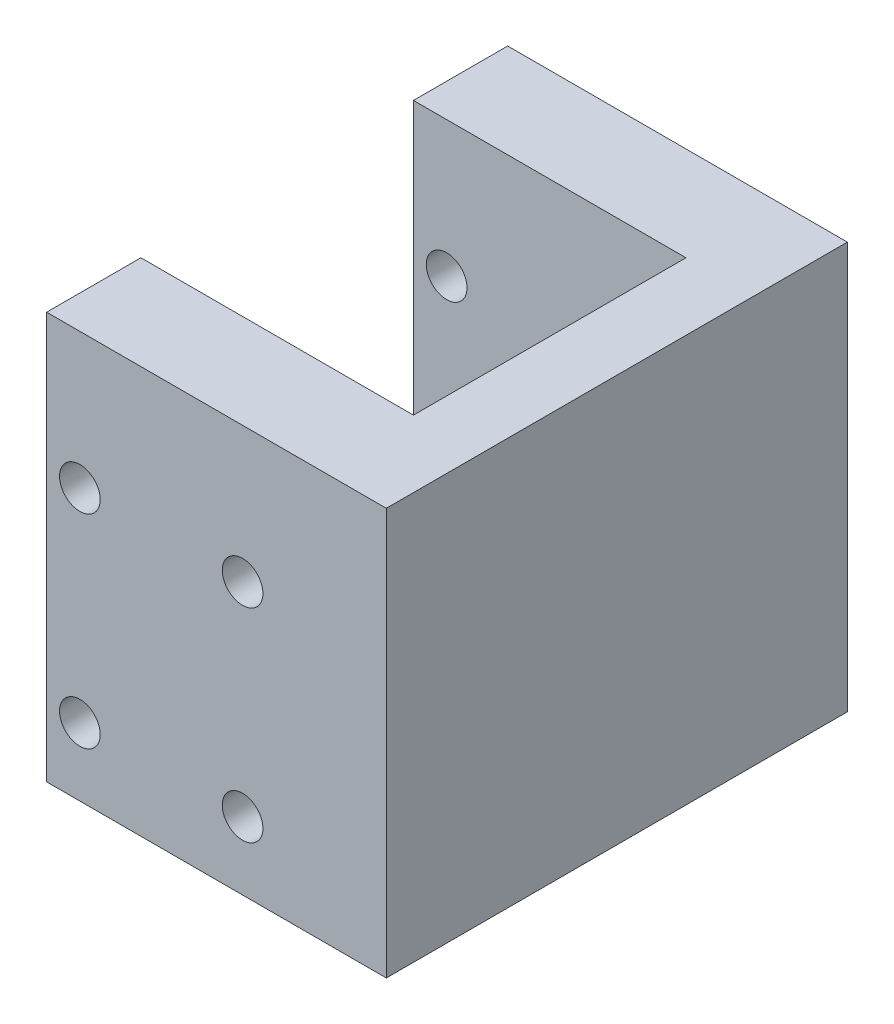
ISO-10303-21;
HEADER;
FILE_DESCRIPTION(('STEP AP214'),'2;1');
FILE_NAME('part.step','',(''),(''),'','','');
FILE_SCHEMA(('AUTOMOTIVE_DESIGN { 1 0 10303 214 1 1 1 1 }'));
ENDSEC;
DATA;
#1=APPLICATION_CONTEXT('core data for automotive mechanical design processes');
#2=APPLICATION_PROTOCOL_DEFINITION('international standard','automotive_design',2000,#1);
#3=PRODUCT_CONTEXT('',#1,'mechanical');
#4=PRODUCT('Part','Part','',(#3));
#5=PRODUCT_RELATED_PRODUCT_CATEGORY('part','',(#4));
#6=PRODUCT_DEFINITION_FORMATION('','',#4);
#7=PRODUCT_DEFINITION_CONTEXT('part definition',#1,'design');
#8=PRODUCT_DEFINITION('design','',#6,#7);
#9=PRODUCT_DEFINITION_SHAPE('','',#8);
#10=(LENGTH_UNIT() NAMED_UNIT(*) SI_UNIT(.MILLI.,.METRE.));
#11=(NAMED_UNIT(*) PLANE_ANGLE_UNIT() SI_UNIT($,.RADIAN.));
#12=(NAMED_UNIT(*) SI_UNIT($,.STERADIAN.) SOLID_ANGLE_UNIT());
#13=UNCERTAINTY_MEASURE_WITH_UNIT(LENGTH_MEASURE(1.E-05),#10,'distance_accuracy_value','');
#14=(GEOMETRIC_REPRESENTATION_CONTEXT(3) GLOBAL_UNCERTAINTY_ASSIGNED_CONTEXT((#13)) GLOBAL_UNIT_ASSIGNED_CONTEXT((#10,
#11,#12)) REPRESENTATION_CONTEXT('',''));
#15=CARTESIAN_POINT('',(0.,0.,0.));
#16=DIRECTION('',(0.,0.,1.));
#17=DIRECTION('',(1.,0.,0.));
#18=AXIS2_PLACEMENT_3D('',#15,#16,#17);
#19=CARTESIAN_POINT('',(-398.815803698117,-320.,0.));
#20=DIRECTION('',(-1.,0.,0.));
#21=DIRECTION('',(0.,0.,1.));
#22=AXIS2_PLACEMENT_3D('',#19,#20,#21);
#23=PLANE('',#22);
#24=DIRECTION('',(0.,-1.,0.));
#25=VECTOR('',#24,1.);
#26=CARTESIAN_POINT('',(-398.815803698117,-320.,-345.55));
#27=LINE('',#26,#25);
#28=CARTESIAN_POINT('',(-398.815803698117,-320.,-345.55));
#29=VERTEX_POINT('',#28);
#30=CARTESIAN_POINT('',(-398.815803698117,-350.,-345.55));
#31=VERTEX_POINT('',#30);
#32=EDGE_CURVE('E135',#29,#31,#27,.T.);
#33=ORIENTED_EDGE('',*,*,#32,.T.);
#34=DIRECTION('',(0.,0.,-1.));
#35=VECTOR('',#34,1.);
#36=CARTESIAN_POINT('',(-398.815803698117,-350.,0.));
#37=LINE('',#36,#35);
#38=CARTESIAN_POINT('',(-398.815803698117,-350.,-338.6));
#39=VERTEX_POINT('',#38);
#40=EDGE_CURVE('E166',#39,#31,#37,.T.);
#41=ORIENTED_EDGE('',*,*,#40,.F.);
#42=DIRECTION('',(0.,-1.,0.));
#43=VECTOR('',#42,1.);
#44=CARTESIAN_POINT('',(-398.815803698117,-320.,-338.6));
#45=LINE('',#44,#43);
#46=CARTESIAN_POINT('',(-398.815803698117,-320.,-338.6));
#47=VERTEX_POINT('',#46);
#48=EDGE_CURVE('E12',#47,#39,#45,.T.);
#49=ORIENTED_EDGE('',*,*,#48,.F.);
#50=DIRECTION('',(0.,0.,-1.));
#51=VECTOR('',#50,1.);
#52=CARTESIAN_POINT('',(-398.815803698117,-320.,0.));
#53=LINE('',#52,#51);
#54=EDGE_CURVE('E148',#47,#29,#53,.T.);
#55=ORIENTED_EDGE('',*,*,#54,.T.);
#56=EDGE_LOOP('',(#33,#41,#49,#55));
#57=FACE_BOUND('',#56,.T.);
#58=ADVANCED_FACE('F61',(#57),#23,.T.);
#59=DIRECTION('',(0.,-1.,0.));
#60=VECTOR('',#59,1.);
#61=CARTESIAN_POINT('',(-398.815803698117,-320.,-365.65));
#62=LINE('',#61,#60);
#63=CARTESIAN_POINT('',(-398.815803698117,-320.,-365.65));
#64=VERTEX_POINT('',#63);
#65=CARTESIAN_POINT('',(-398.815803698117,-350.,-365.65));
#66=VERTEX_POINT('',#65);
#67=EDGE_CURVE('E78',#64,#66,#62,.T.);
#68=ORIENTED_EDGE('',*,*,#67,.F.);
#69=CARTESIAN_POINT('',(-398.815803698117,-320.,-372.6));
#70=VERTEX_POINT('',#69);
#71=EDGE_CURVE('E110',#64,#70,#53,.T.);
#72=ORIENTED_EDGE('',*,*,#71,.T.);
#73=DIRECTION('',(0.,-1.,0.));
#74=VECTOR('',#73,1.);
#75=CARTESIAN_POINT('',(-398.815803698117,-320.,-372.6));
#76=LINE('',#75,#74);
#77=CARTESIAN_POINT('',(-398.815803698117,-350.,-372.6));
#78=VERTEX_POINT('',#77);
#79=EDGE_CURVE('E165',#70,#78,#76,.T.);
#80=ORIENTED_EDGE('',*,*,#79,.T.);
#81=EDGE_CURVE('E169',#66,#78,#37,.T.);
#82=ORIENTED_EDGE('',*,*,#81,.F.);
#83=EDGE_LOOP('',(#68,#72,#80,#82));
#84=FACE_BOUND('',#83,.T.);
#85=ADVANCED_FACE('F63',(#84),#23,.T.);
#86=CARTESIAN_POINT('',(0.,-320.,-338.6));
#87=DIRECTION('',(0.,0.,-1.));
#88=DIRECTION('',(-1.,0.,0.));
#89=AXIS2_PLACEMENT_3D('',#86,#87,#88);
#90=PLANE('',#89);
#91=CARTESIAN_POINT('',(-396.365803698117,-345.,-338.6));
#92=DIRECTION('',(0.,0.,1.));
#93=DIRECTION('',(1.,0.,0.));
#94=AXIS2_PLACEMENT_3D('',#91,#92,#93);
#95=CIRCLE('',#94,1.50000000000002);
#96=CARTESIAN_POINT('',(-394.865803698117,-345.,-338.6));
#97=VERTEX_POINT('',#96);
#98=EDGE_CURVE('E441',#97,#97,#95,.T.);
#99=ORIENTED_EDGE('',*,*,#98,.F.);
#100=EDGE_LOOP('',(#99));
#101=FACE_BOUND('',#100,.T.);
#102=CARTESIAN_POINT('',(-384.365803698117,-330.,-338.6));
#103=DIRECTION('',(0.,0.,1.));
#104=DIRECTION('',(1.,0.,0.));
#105=AXIS2_PLACEMENT_3D('',#102,#103,#104);
#106=CIRCLE('',#105,1.50000000000002);
#107=CARTESIAN_POINT('',(-382.865803698117,-330.,-338.6));
#108=VERTEX_POINT('',#107);
#109=EDGE_CURVE('E457',#108,#108,#106,.T.);
#110=ORIENTED_EDGE('',*,*,#109,.F.);
#111=EDGE_LOOP('',(#110));
#112=FACE_BOUND('',#111,.T.);
#113=CARTESIAN_POINT('',(-396.365803698117,-330.,-338.6));
#114=DIRECTION('',(0.,0.,1.));
#115=DIRECTION('',(1.,0.,0.));
#116=AXIS2_PLACEMENT_3D('',#113,#114,#115);
#117=CIRCLE('',#116,1.50000000000002);
#118=CARTESIAN_POINT('',(-394.865803698117,-330.,-338.6));
#119=VERTEX_POINT('',#118);
#120=EDGE_CURVE('E474',#119,#119,#117,.T.);
#121=ORIENTED_EDGE('',*,*,#120,.F.);
#122=EDGE_LOOP('',(#121));
#123=FACE_BOUND('',#122,.T.);
#124=CARTESIAN_POINT('',(-384.365803698117,-345.,-338.6));
#125=DIRECTION('',(0.,0.,1.));
#126=DIRECTION('',(1.,0.,0.));
#127=AXIS2_PLACEMENT_3D('',#124,#125,#126);
#128=CIRCLE('',#127,1.50000000000002);
#129=CARTESIAN_POINT('',(-382.865803698117,-345.,-338.6));
#130=VERTEX_POINT('',#129);
#131=EDGE_CURVE('E454',#130,#130,#128,.T.);
#132=ORIENTED_EDGE('',*,*,#131,.F.);
#133=EDGE_LOOP('',(#132));
#134=FACE_BOUND('',#133,.T.);
#135=DIRECTION('',(1.,0.,0.));
#136=VECTOR('',#135,1.);
#137=CARTESIAN_POINT('',(0.,-350.,-338.6));
#138=LINE('',#137,#136);
#139=CARTESIAN_POINT('',(-373.765803698117,-350.,-338.6));
#140=VERTEX_POINT('',#139);
#141=EDGE_CURVE('E159',#39,#140,#138,.T.);
#142=ORIENTED_EDGE('',*,*,#141,.T.);
#143=DIRECTION('',(0.,-1.,0.));
#144=VECTOR('',#143,1.);
#145=CARTESIAN_POINT('',(-373.765803698117,-320.,-338.6));
#146=LINE('',#145,#144);
#147=CARTESIAN_POINT('',(-373.765803698117,-320.,-338.6));
#148=VERTEX_POINT('',#147);
#149=EDGE_CURVE('E70',#148,#140,#146,.T.);
#150=ORIENTED_EDGE('',*,*,#149,.F.);
#151=DIRECTION('',(1.,0.,0.));
#152=VECTOR('',#151,1.);
#153=CARTESIAN_POINT('',(0.,-320.,-338.6));
#154=LINE('',#153,#152);
#155=EDGE_CURVE('E163',#47,#148,#154,.T.);
#156=ORIENTED_EDGE('',*,*,#155,.F.);
#157=ORIENTED_EDGE('',*,*,#48,.T.);
#158=EDGE_LOOP('',(#142,#150,#156,#157));
#159=FACE_BOUND('',#158,.T.);
#160=ADVANCED_FACE('F225',(#101,#112,#123,#134,#159),#90,.F.);
#161=CARTESIAN_POINT('',(-373.765803698117,-320.,0.));
#162=DIRECTION('',(-1.,0.,0.));
#163=DIRECTION('',(0.,0.,1.));
#164=AXIS2_PLACEMENT_3D('',#161,#162,#163);
#165=PLANE('',#164);
#166=DIRECTION('',(0.,0.,-1.));
#167=VECTOR('',#166,1.);
#168=CARTESIAN_POINT('',(-373.765803698117,-350.,0.));
#169=LINE('',#168,#167);
#170=CARTESIAN_POINT('',(-373.765803698117,-350.,-372.6));
#171=VERTEX_POINT('',#170);
#172=EDGE_CURVE('E172',#140,#171,#169,.T.);
#173=ORIENTED_EDGE('',*,*,#172,.T.);
#174=DIRECTION('',(0.,-1.,0.));
#175=VECTOR('',#174,1.);
#176=CARTESIAN_POINT('',(-373.765803698117,-320.,-372.6));
#177=LINE('',#176,#175);
#178=CARTESIAN_POINT('',(-373.765803698117,-320.,-372.6));
#179=VERTEX_POINT('',#178);
#180=EDGE_CURVE('E178',#179,#171,#177,.T.);
#181=ORIENTED_EDGE('',*,*,#180,.F.);
#182=DIRECTION('',(0.,0.,-1.));
#183=VECTOR('',#182,1.);
#184=CARTESIAN_POINT('',(-373.765803698117,-320.,0.));
#185=LINE('',#184,#183);
#186=EDGE_CURVE('E157',#148,#179,#185,.T.);
#187=ORIENTED_EDGE('',*,*,#186,.F.);
#188=ORIENTED_EDGE('',*,*,#149,.T.);
#189=EDGE_LOOP('',(#173,#181,#187,#188));
#190=FACE_BOUND('',#189,.T.);
#191=ADVANCED_FACE('F228',(#190),#165,.F.);
#192=CARTESIAN_POINT('',(0.,-320.,-372.6));
#193=DIRECTION('',(0.,0.,-1.));
#194=DIRECTION('',(-1.,0.,0.));
#195=AXIS2_PLACEMENT_3D('',#192,#193,#194);
#196=PLANE('',#195);
#197=DIRECTION('',(1.,0.,0.));
#198=VECTOR('',#197,1.);
#199=CARTESIAN_POINT('',(0.,-350.,-372.6));
#200=LINE('',#199,#198);
#201=EDGE_CURVE('E168',#78,#171,#200,.T.);
#202=ORIENTED_EDGE('',*,*,#201,.F.);
#203=ORIENTED_EDGE('',*,*,#79,.F.);
#204=DIRECTION('',(1.,0.,0.));
#205=VECTOR('',#204,1.);
#206=CARTESIAN_POINT('',(0.,-320.,-372.6));
#207=LINE('',#206,#205);
#208=EDGE_CURVE('E154',#70,#179,#207,.T.);
#209=ORIENTED_EDGE('',*,*,#208,.T.);
#210=ORIENTED_EDGE('',*,*,#180,.T.);
#211=EDGE_LOOP('',(#202,#203,#209,#210));
#212=FACE_BOUND('',#211,.T.);
#213=ADVANCED_FACE('F233',(#212),#196,.T.);
#214=CARTESIAN_POINT('',(0.,-320.,0.));
#215=DIRECTION('',(0.,-1.,0.));
#216=DIRECTION('',(0.,0.,-1.));
#217=AXIS2_PLACEMENT_3D('',#214,#215,#216);
#218=PLANE('',#217);
#219=DIRECTION('',(0.,0.,1.));
#220=VECTOR('',#219,1.);
#221=CARTESIAN_POINT('',(-378.715803698117,-320.,-365.65));
#222=LINE('',#221,#220);
#223=CARTESIAN_POINT('',(-378.715803698117,-320.,-365.65));
#224=VERTEX_POINT('',#223);
#225=CARTESIAN_POINT('',(-378.715803698117,-320.,-345.55));
#226=VERTEX_POINT('',#225);
#227=EDGE_CURVE('E143',#224,#226,#222,.T.);
#228=ORIENTED_EDGE('',*,*,#227,.T.);
#229=DIRECTION('',(-1.,0.,0.));
#230=VECTOR('',#229,1.);
#231=CARTESIAN_POINT('',(-378.715803698117,-320.,-345.55));
#232=LINE('',#231,#230);
#233=EDGE_CURVE('E138',#226,#29,#232,.T.);
#234=ORIENTED_EDGE('',*,*,#233,.T.);
#235=ORIENTED_EDGE('',*,*,#54,.F.);
#236=ORIENTED_EDGE('',*,*,#155,.T.);
#237=ORIENTED_EDGE('',*,*,#186,.T.);
#238=ORIENTED_EDGE('',*,*,#208,.F.);
#239=ORIENTED_EDGE('',*,*,#71,.F.);
#240=DIRECTION('',(1.,0.,0.));
#241=VECTOR('',#240,1.);
#242=CARTESIAN_POINT('',(-398.815803698117,-320.,-365.65));
#243=LINE('',#242,#241);
#244=EDGE_CURVE('E151',#64,#224,#243,.T.);
#245=ORIENTED_EDGE('',*,*,#244,.T.);
#246=EDGE_LOOP('',(#228,#234,#235,#236,#237,#238,#239,#245));
#247=FACE_BOUND('',#246,.T.);
#248=ADVANCED_FACE('F147',(#247),#218,.F.);
#249=CARTESIAN_POINT('',(0.,-350.,0.));
#250=DIRECTION('',(0.,-1.,0.));
#251=DIRECTION('',(0.,0.,-1.));
#252=AXIS2_PLACEMENT_3D('',#249,#250,#251);
#253=PLANE('',#252);
#254=DIRECTION('',(-1.,0.,0.));
#255=VECTOR('',#254,1.);
#256=CARTESIAN_POINT('',(-378.715803698117,-350.,-345.55));
#257=LINE('',#256,#255);
#258=CARTESIAN_POINT('',(-378.715803698117,-350.,-345.55));
#259=VERTEX_POINT('',#258);
#260=EDGE_CURVE('E141',#259,#31,#257,.T.);
#261=ORIENTED_EDGE('',*,*,#260,.F.);
#262=DIRECTION('',(0.,0.,1.));
#263=VECTOR('',#262,1.);
#264=CARTESIAN_POINT('',(-378.715803698117,-350.,-365.65));
#265=LINE('',#264,#263);
#266=CARTESIAN_POINT('',(-378.715803698117,-350.,-365.65));
#267=VERTEX_POINT('',#266);
#268=EDGE_CURVE('E152',#267,#259,#265,.T.);
#269=ORIENTED_EDGE('',*,*,#268,.F.);
#270=DIRECTION('',(1.,0.,0.));
#271=VECTOR('',#270,1.);
#272=CARTESIAN_POINT('',(-398.815803698117,-350.,-365.65));
#273=LINE('',#272,#271);
#274=EDGE_CURVE('E209',#66,#267,#273,.T.);
#275=ORIENTED_EDGE('',*,*,#274,.F.);
#276=ORIENTED_EDGE('',*,*,#81,.T.);
#277=ORIENTED_EDGE('',*,*,#201,.T.);
#278=ORIENTED_EDGE('',*,*,#172,.F.);
#279=ORIENTED_EDGE('',*,*,#141,.F.);
#280=ORIENTED_EDGE('',*,*,#40,.T.);
#281=EDGE_LOOP('',(#261,#269,#275,#276,#277,#278,#279,#280));
#282=FACE_BOUND('',#281,.T.);
#283=ADVANCED_FACE('F222',(#282),#253,.T.);
#284=CARTESIAN_POINT('',(-378.715803698117,-320.,-345.55));
#285=DIRECTION('',(0.,0.,1.));
#286=DIRECTION('',(1.,0.,0.));
#287=AXIS2_PLACEMENT_3D('',#284,#285,#286);
#288=PLANE('',#287);
#289=CARTESIAN_POINT('',(-396.365803698117,-345.,-345.55));
#290=DIRECTION('',(0.,0.,1.));
#291=DIRECTION('',(1.,0.,0.));
#292=AXIS2_PLACEMENT_3D('',#289,#290,#291);
#293=CIRCLE('',#292,1.50000000000002);
#294=CARTESIAN_POINT('',(-394.865803698117,-345.,-345.55));
#295=VERTEX_POINT('',#294);
#296=EDGE_CURVE('E203',#295,#295,#293,.T.);
#297=ORIENTED_EDGE('',*,*,#296,.T.);
#298=EDGE_LOOP('',(#297));
#299=FACE_BOUND('',#298,.T.);
#300=CARTESIAN_POINT('',(-384.365803698117,-330.,-345.55));
#301=DIRECTION('',(0.,0.,1.));
#302=DIRECTION('',(1.,0.,0.));
#303=AXIS2_PLACEMENT_3D('',#300,#301,#302);
#304=CIRCLE('',#303,1.50000000000002);
#305=CARTESIAN_POINT('',(-382.865803698117,-330.,-345.55));
#306=VERTEX_POINT('',#305);
#307=EDGE_CURVE('E191',#306,#306,#304,.T.);
#308=ORIENTED_EDGE('',*,*,#307,.T.);
#309=EDGE_LOOP('',(#308));
#310=FACE_BOUND('',#309,.T.);
#311=CARTESIAN_POINT('',(-396.365803698117,-330.,-345.55));
#312=DIRECTION('',(0.,0.,1.));
#313=DIRECTION('',(1.,0.,0.));
#314=AXIS2_PLACEMENT_3D('',#311,#312,#313);
#315=CIRCLE('',#314,1.50000000000002);
#316=CARTESIAN_POINT('',(-394.865803698117,-330.,-345.55));
#317=VERTEX_POINT('',#316);
#318=EDGE_CURVE('E188',#317,#317,#315,.T.);
#319=ORIENTED_EDGE('',*,*,#318,.T.);
#320=EDGE_LOOP('',(#319));
#321=FACE_BOUND('',#320,.T.);
#322=CARTESIAN_POINT('',(-384.365803698117,-345.,-345.55));
#323=DIRECTION('',(0.,0.,1.));
#324=DIRECTION('',(1.,0.,0.));
#325=AXIS2_PLACEMENT_3D('',#322,#323,#324);
#326=CIRCLE('',#325,1.50000000000002);
#327=CARTESIAN_POINT('',(-382.865803698117,-345.,-345.55));
#328=VERTEX_POINT('',#327);
#329=EDGE_CURVE('E184',#328,#328,#326,.T.);
#330=ORIENTED_EDGE('',*,*,#329,.T.);
#331=EDGE_LOOP('',(#330));
#332=FACE_BOUND('',#331,.T.);
#333=ORIENTED_EDGE('',*,*,#260,.T.);
#334=ORIENTED_EDGE('',*,*,#32,.F.);
#335=ORIENTED_EDGE('',*,*,#233,.F.);
#336=DIRECTION('',(0.,-1.,0.));
#337=VECTOR('',#336,1.);
#338=CARTESIAN_POINT('',(-378.715803698117,-320.,-345.55));
#339=LINE('',#338,#337);
#340=EDGE_CURVE('E213',#226,#259,#339,.T.);
#341=ORIENTED_EDGE('',*,*,#340,.T.);
#342=EDGE_LOOP('',(#333,#334,#335,#341));
#343=FACE_BOUND('',#342,.T.);
#344=ADVANCED_FACE('F137',(#299,#310,#321,#332,#343),#288,.F.);
#345=CARTESIAN_POINT('',(-378.715803698117,-320.,-365.65));
#346=DIRECTION('',(1.,0.,0.));
#347=DIRECTION('',(0.,0.,-1.));
#348=AXIS2_PLACEMENT_3D('',#345,#346,#347);
#349=PLANE('',#348);
#350=ORIENTED_EDGE('',*,*,#268,.T.);
#351=ORIENTED_EDGE('',*,*,#340,.F.);
#352=ORIENTED_EDGE('',*,*,#227,.F.);
#353=DIRECTION('',(0.,-1.,0.));
#354=VECTOR('',#353,1.);
#355=CARTESIAN_POINT('',(-378.715803698117,-320.,-365.65));
#356=LINE('',#355,#354);
#357=EDGE_CURVE('E215',#224,#267,#356,.T.);
#358=ORIENTED_EDGE('',*,*,#357,.T.);
#359=EDGE_LOOP('',(#350,#351,#352,#358));
#360=FACE_BOUND('',#359,.T.);
#361=ADVANCED_FACE('F217',(#360),#349,.F.);
#362=CARTESIAN_POINT('',(-398.815803698117,-320.,-365.65));
#363=DIRECTION('',(0.,0.,-1.));
#364=DIRECTION('',(-1.,0.,0.));
#365=AXIS2_PLACEMENT_3D('',#362,#363,#364);
#366=PLANE('',#365);
#367=CARTESIAN_POINT('',(-396.365803698117,-345.,-365.65));
#368=DIRECTION('',(0.,0.,-1.));
#369=DIRECTION('',(-1.,0.,0.));
#370=AXIS2_PLACEMENT_3D('',#367,#368,#369);
#371=CIRCLE('',#370,1.50000000000002);
#372=CARTESIAN_POINT('',(-397.865803698117,-345.,-365.65));
#373=VERTEX_POINT('',#372);
#374=EDGE_CURVE('E65',#373,#373,#371,.T.);
#375=ORIENTED_EDGE('',*,*,#374,.T.);
#376=EDGE_LOOP('',(#375));
#377=FACE_BOUND('',#376,.T.);
#378=CARTESIAN_POINT('',(-384.365803698117,-330.,-365.65));
#379=DIRECTION('',(0.,0.,-1.));
#380=DIRECTION('',(-1.,0.,0.));
#381=AXIS2_PLACEMENT_3D('',#378,#379,#380);
#382=CIRCLE('',#381,1.50000000000002);
#383=CARTESIAN_POINT('',(-385.865803698117,-330.,-365.65));
#384=VERTEX_POINT('',#383);
#385=EDGE_CURVE('E189',#384,#384,#382,.T.);
#386=ORIENTED_EDGE('',*,*,#385,.T.);
#387=EDGE_LOOP('',(#386));
#388=FACE_BOUND('',#387,.T.);
#389=CARTESIAN_POINT('',(-396.365803698117,-330.,-365.65));
#390=DIRECTION('',(0.,0.,-1.));
#391=DIRECTION('',(-1.,0.,0.));
#392=AXIS2_PLACEMENT_3D('',#389,#390,#391);
#393=CIRCLE('',#392,1.50000000000002);
#394=CARTESIAN_POINT('',(-397.865803698117,-330.,-365.65));
#395=VERTEX_POINT('',#394);
#396=EDGE_CURVE('E186',#395,#395,#393,.T.);
#397=ORIENTED_EDGE('',*,*,#396,.T.);
#398=EDGE_LOOP('',(#397));
#399=FACE_BOUND('',#398,.T.);
#400=CARTESIAN_POINT('',(-384.365803698117,-345.,-365.65));
#401=DIRECTION('',(0.,0.,-1.));
#402=DIRECTION('',(-1.,0.,0.));
#403=AXIS2_PLACEMENT_3D('',#400,#401,#402);
#404=CIRCLE('',#403,1.50000000000002);
#405=CARTESIAN_POINT('',(-385.865803698117,-345.,-365.65));
#406=VERTEX_POINT('',#405);
#407=EDGE_CURVE('E181',#406,#406,#404,.T.);
#408=ORIENTED_EDGE('',*,*,#407,.T.);
#409=EDGE_LOOP('',(#408));
#410=FACE_BOUND('',#409,.T.);
#411=ORIENTED_EDGE('',*,*,#274,.T.);
#412=ORIENTED_EDGE('',*,*,#357,.F.);
#413=ORIENTED_EDGE('',*,*,#244,.F.);
#414=ORIENTED_EDGE('',*,*,#67,.T.);
#415=EDGE_LOOP('',(#411,#412,#413,#414));
#416=FACE_BOUND('',#415,.T.);
#417=ADVANCED_FACE('F219',(#377,#388,#399,#410,#416),#366,.F.);
#418=CARTESIAN_POINT('',(-384.365803698117,-345.,-368.6));
#419=DIRECTION('',(0.,0.,1.));
#420=DIRECTION('',(1.,0.,0.));
#421=AXIS2_PLACEMENT_3D('',#418,#419,#420);
#422=PLANE('',#421);
#423=CARTESIAN_POINT('',(-384.365803698117,-345.,-368.6));
#424=DIRECTION('',(0.,0.,1.));
#425=DIRECTION('',(1.,0.,0.));
#426=AXIS2_PLACEMENT_3D('',#423,#424,#425);
#427=CIRCLE('',#426,1.50000000000002);
#428=CARTESIAN_POINT('',(-382.865803698117,-345.,-368.6));
#429=VERTEX_POINT('',#428);
#430=EDGE_CURVE('E185',#429,#429,#427,.T.);
#431=ORIENTED_EDGE('',*,*,#430,.T.);
#432=EDGE_LOOP('',(#431));
#433=FACE_BOUND('',#432,.T.);
#434=ADVANCED_FACE('F318',(#433),#422,.T.);
#435=CARTESIAN_POINT('',(-384.365803698117,-345.,-368.6));
#436=DIRECTION('',(0.,0.,1.));
#437=DIRECTION('',(1.,0.,0.));
#438=AXIS2_PLACEMENT_3D('',#435,#436,#437);
#439=CYLINDRICAL_SURFACE('',#438,1.50000000000002);
#440=ORIENTED_EDGE('',*,*,#430,.F.);
#441=EDGE_LOOP('',(#440));
#442=FACE_BOUND('',#441,.T.);
#443=ORIENTED_EDGE('',*,*,#407,.F.);
#444=EDGE_LOOP('',(#443));
#445=FACE_BOUND('',#444,.T.);
#446=ADVANCED_FACE('F328',(#442,#445),#439,.F.);
#447=CARTESIAN_POINT('',(-396.365803698117,-330.,-368.6));
#448=DIRECTION('',(0.,0.,1.));
#449=DIRECTION('',(1.,0.,0.));
#450=AXIS2_PLACEMENT_3D('',#447,#448,#449);
#451=PLANE('',#450);
#452=CARTESIAN_POINT('',(-396.365803698117,-330.,-368.6));
#453=DIRECTION('',(0.,0.,1.));
#454=DIRECTION('',(1.,0.,0.));
#455=AXIS2_PLACEMENT_3D('',#452,#453,#454);
#456=CIRCLE('',#455,1.50000000000002);
#457=CARTESIAN_POINT('',(-394.865803698117,-330.,-368.6));
#458=VERTEX_POINT('',#457);
#459=EDGE_CURVE('E463',#458,#458,#456,.T.);
#460=ORIENTED_EDGE('',*,*,#459,.T.);
#461=EDGE_LOOP('',(#460));
#462=FACE_BOUND('',#461,.T.);
#463=ADVANCED_FACE('F338',(#462),#451,.T.);
#464=CARTESIAN_POINT('',(-396.365803698117,-330.,-368.6));
#465=DIRECTION('',(0.,0.,1.));
#466=DIRECTION('',(1.,0.,0.));
#467=AXIS2_PLACEMENT_3D('',#464,#465,#466);
#468=CYLINDRICAL_SURFACE('',#467,1.50000000000002);
#469=ORIENTED_EDGE('',*,*,#459,.F.);
#470=EDGE_LOOP('',(#469));
#471=FACE_BOUND('',#470,.T.);
#472=ORIENTED_EDGE('',*,*,#396,.F.);
#473=EDGE_LOOP('',(#472));
#474=FACE_BOUND('',#473,.T.);
#475=ADVANCED_FACE('F349',(#471,#474),#468,.F.);
#476=CARTESIAN_POINT('',(-384.365803698117,-330.,-368.6));
#477=DIRECTION('',(0.,0.,1.));
#478=DIRECTION('',(1.,0.,0.));
#479=AXIS2_PLACEMENT_3D('',#476,#477,#478);
#480=PLANE('',#479);
#481=CARTESIAN_POINT('',(-384.365803698117,-330.,-368.6));
#482=DIRECTION('',(0.,0.,1.));
#483=DIRECTION('',(1.,0.,0.));
#484=AXIS2_PLACEMENT_3D('',#481,#482,#483);
#485=CIRCLE('',#484,1.50000000000002);
#486=CARTESIAN_POINT('',(-382.865803698117,-330.,-368.6));
#487=VERTEX_POINT('',#486);
#488=EDGE_CURVE('E451',#487,#487,#485,.T.);
#489=ORIENTED_EDGE('',*,*,#488,.T.);
#490=EDGE_LOOP('',(#489));
#491=FACE_BOUND('',#490,.T.);
#492=ADVANCED_FACE('F359',(#491),#480,.T.);
#493=CARTESIAN_POINT('',(-384.365803698117,-330.,-368.6));
#494=DIRECTION('',(0.,0.,1.));
#495=DIRECTION('',(1.,0.,0.));
#496=AXIS2_PLACEMENT_3D('',#493,#494,#495);
#497=CYLINDRICAL_SURFACE('',#496,1.50000000000002);
#498=ORIENTED_EDGE('',*,*,#488,.F.);
#499=EDGE_LOOP('',(#498));
#500=FACE_BOUND('',#499,.T.);
#501=ORIENTED_EDGE('',*,*,#385,.F.);
#502=EDGE_LOOP('',(#501));
#503=FACE_BOUND('',#502,.T.);
#504=ADVANCED_FACE('F370',(#500,#503),#497,.F.);
#505=CARTESIAN_POINT('',(-396.365803698117,-345.,-368.6));
#506=DIRECTION('',(0.,0.,1.));
#507=DIRECTION('',(1.,0.,0.));
#508=AXIS2_PLACEMENT_3D('',#505,#506,#507);
#509=PLANE('',#508);
#510=CARTESIAN_POINT('',(-396.365803698117,-345.,-368.6));
#511=DIRECTION('',(0.,0.,1.));
#512=DIRECTION('',(1.,0.,0.));
#513=AXIS2_PLACEMENT_3D('',#510,#511,#512);
#514=CIRCLE('',#513,1.50000000000002);
#515=CARTESIAN_POINT('',(-394.865803698117,-345.,-368.6));
#516=VERTEX_POINT('',#515);
#517=EDGE_CURVE('E450',#516,#516,#514,.T.);
#518=ORIENTED_EDGE('',*,*,#517,.T.);
#519=EDGE_LOOP('',(#518));
#520=FACE_BOUND('',#519,.T.);
#521=ADVANCED_FACE('F380',(#520),#509,.T.);
#522=CARTESIAN_POINT('',(-396.365803698117,-345.,-368.6));
#523=DIRECTION('',(0.,0.,1.));
#524=DIRECTION('',(1.,0.,0.));
#525=AXIS2_PLACEMENT_3D('',#522,#523,#524);
#526=CYLINDRICAL_SURFACE('',#525,1.50000000000002);
#527=ORIENTED_EDGE('',*,*,#517,.F.);
#528=EDGE_LOOP('',(#527));
#529=FACE_BOUND('',#528,.T.);
#530=ORIENTED_EDGE('',*,*,#374,.F.);
#531=EDGE_LOOP('',(#530));
#532=FACE_BOUND('',#531,.T.);
#533=ADVANCED_FACE('F391',(#529,#532),#526,.F.);
#534=ORIENTED_EDGE('',*,*,#131,.T.);
#535=EDGE_LOOP('',(#534));
#536=FACE_BOUND('',#535,.T.);
#537=ORIENTED_EDGE('',*,*,#329,.F.);
#538=EDGE_LOOP('',(#537));
#539=FACE_BOUND('',#538,.T.);
#540=ADVANCED_FACE('F341',(#536,#539),#439,.F.);
#541=ORIENTED_EDGE('',*,*,#120,.T.);
#542=EDGE_LOOP('',(#541));
#543=FACE_BOUND('',#542,.T.);
#544=ORIENTED_EDGE('',*,*,#318,.F.);
#545=EDGE_LOOP('',(#544));
#546=FACE_BOUND('',#545,.T.);
#547=ADVANCED_FACE('F362',(#543,#546),#468,.F.);
#548=ORIENTED_EDGE('',*,*,#109,.T.);
#549=EDGE_LOOP('',(#548));
#550=FACE_BOUND('',#549,.T.);
#551=ORIENTED_EDGE('',*,*,#307,.F.);
#552=EDGE_LOOP('',(#551));
#553=FACE_BOUND('',#552,.T.);
#554=ADVANCED_FACE('F383',(#550,#553),#497,.F.);
#555=ORIENTED_EDGE('',*,*,#98,.T.);
#556=EDGE_LOOP('',(#555));
#557=FACE_BOUND('',#556,.T.);
#558=ORIENTED_EDGE('',*,*,#296,.F.);
#559=EDGE_LOOP('',(#558));
#560=FACE_BOUND('',#559,.T.);
#561=ADVANCED_FACE('F403',(#557,#560),#526,.F.);
#562=CLOSED_SHELL('',(#58,#85,#160,#191,#213,#248,#283,#344,#361,#417,#434,#446,#463,#475,#492,
#504,#521,#533,#540,#547,#554,#561));
#563=MANIFOLD_SOLID_BREP('B2',#562);
#564=ADVANCED_BREP_SHAPE_REPRESENTATION('',(#18,#563),#14);
#565=SHAPE_DEFINITION_REPRESENTATION(#9,#564);
ENDSEC;
END-ISO-10303-21;
